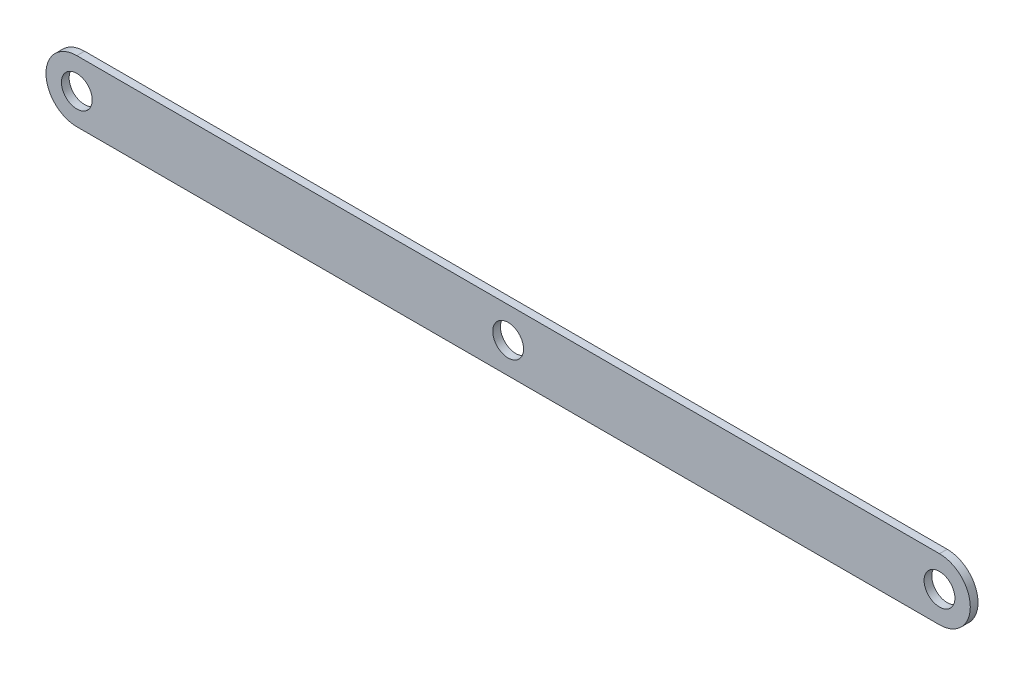
ISO-10303-21;
HEADER;
FILE_DESCRIPTION(('STEP AP214'),'2;1');
FILE_NAME('part.step','',(''),(''),'','','');
FILE_SCHEMA(('AUTOMOTIVE_DESIGN { 1 0 10303 214 1 1 1 1 }'));
ENDSEC;
DATA;
#1=APPLICATION_CONTEXT('core data for automotive mechanical design processes');
#2=APPLICATION_PROTOCOL_DEFINITION('international standard','automotive_design',2000,#1);
#3=PRODUCT_CONTEXT('',#1,'mechanical');
#4=PRODUCT('Part','Part','',(#3));
#5=PRODUCT_RELATED_PRODUCT_CATEGORY('part','',(#4));
#6=PRODUCT_DEFINITION_FORMATION('','',#4);
#7=PRODUCT_DEFINITION_CONTEXT('part definition',#1,'design');
#8=PRODUCT_DEFINITION('design','',#6,#7);
#9=PRODUCT_DEFINITION_SHAPE('','',#8);
#10=(LENGTH_UNIT() NAMED_UNIT(*) SI_UNIT(.MILLI.,.METRE.));
#11=(NAMED_UNIT(*) PLANE_ANGLE_UNIT() SI_UNIT($,.RADIAN.));
#12=(NAMED_UNIT(*) SI_UNIT($,.STERADIAN.) SOLID_ANGLE_UNIT());
#13=UNCERTAINTY_MEASURE_WITH_UNIT(LENGTH_MEASURE(1.E-05),#10,'distance_accuracy_value','');
#14=(GEOMETRIC_REPRESENTATION_CONTEXT(3) GLOBAL_UNCERTAINTY_ASSIGNED_CONTEXT((#13)) GLOBAL_UNIT_ASSIGNED_CONTEXT((#10,
#11,#12)) REPRESENTATION_CONTEXT('',''));
#15=CARTESIAN_POINT('',(0.,0.,0.));
#16=DIRECTION('',(0.,0.,1.));
#17=DIRECTION('',(1.,0.,0.));
#18=AXIS2_PLACEMENT_3D('',#15,#16,#17);
#19=CARTESIAN_POINT('',(177.8,0.,3.175));
#20=DIRECTION('',(0.,0.,1.));
#21=DIRECTION('',(1.,0.,0.));
#22=AXIS2_PLACEMENT_3D('',#19,#20,#21);
#23=PLANE('',#22);
#24=CARTESIAN_POINT('',(0.,0.,3.175));
#25=DIRECTION('',(0.,0.,1.));
#26=DIRECTION('',(1.,0.,0.));
#27=AXIS2_PLACEMENT_3D('',#24,#25,#26);
#28=CIRCLE('',#27,6.35);
#29=CARTESIAN_POINT('',(6.35,0.,3.175));
#30=VERTEX_POINT('',#29);
#31=EDGE_CURVE('E115',#30,#30,#28,.T.);
#32=ORIENTED_EDGE('',*,*,#31,.F.);
#33=EDGE_LOOP('',(#32));
#34=FACE_BOUND('',#33,.T.);
#35=CARTESIAN_POINT('',(177.8,0.,3.175));
#36=DIRECTION('',(0.,0.,1.));
#37=DIRECTION('',(1.,0.,0.));
#38=AXIS2_PLACEMENT_3D('',#35,#36,#37);
#39=CIRCLE('',#38,12.7);
#40=CARTESIAN_POINT('',(177.8,-12.6999999999999,3.175));
#41=VERTEX_POINT('',#40);
#42=CARTESIAN_POINT('',(177.8,12.7000000000001,3.175));
#43=VERTEX_POINT('',#42);
#44=EDGE_CURVE('E85',#41,#43,#39,.T.);
#45=ORIENTED_EDGE('',*,*,#44,.T.);
#46=DIRECTION('',(-1.,0.,0.));
#47=VECTOR('',#46,1.);
#48=CARTESIAN_POINT('',(177.8,12.7000000000001,3.175));
#49=LINE('',#48,#47);
#50=CARTESIAN_POINT('',(-177.8,12.7,3.175));
#51=VERTEX_POINT('',#50);
#52=EDGE_CURVE('E80',#43,#51,#49,.T.);
#53=ORIENTED_EDGE('',*,*,#52,.T.);
#54=CARTESIAN_POINT('',(-177.8,0.,3.175));
#55=DIRECTION('',(0.,0.,1.));
#56=DIRECTION('',(1.,0.,0.));
#57=AXIS2_PLACEMENT_3D('',#54,#55,#56);
#58=CIRCLE('',#57,12.7);
#59=CARTESIAN_POINT('',(-177.8,-12.7,3.175));
#60=VERTEX_POINT('',#59);
#61=EDGE_CURVE('E83',#51,#60,#58,.T.);
#62=ORIENTED_EDGE('',*,*,#61,.T.);
#63=DIRECTION('',(1.,0.,0.));
#64=VECTOR('',#63,1.);
#65=CARTESIAN_POINT('',(177.8,-12.6999999999999,3.175));
#66=LINE('',#65,#64);
#67=EDGE_CURVE('E50',#60,#41,#66,.T.);
#68=ORIENTED_EDGE('',*,*,#67,.T.);
#69=EDGE_LOOP('',(#45,#53,#62,#68));
#70=FACE_BOUND('',#69,.T.);
#71=CARTESIAN_POINT('',(-177.8,0.,3.175));
#72=DIRECTION('',(0.,0.,1.));
#73=DIRECTION('',(1.,0.,0.));
#74=AXIS2_PLACEMENT_3D('',#71,#72,#73);
#75=CIRCLE('',#74,6.35);
#76=CARTESIAN_POINT('',(-171.45,0.,3.175));
#77=VERTEX_POINT('',#76);
#78=EDGE_CURVE('E100',#77,#77,#75,.T.);
#79=ORIENTED_EDGE('',*,*,#78,.F.);
#80=EDGE_LOOP('',(#79));
#81=FACE_BOUND('',#80,.T.);
#82=CARTESIAN_POINT('',(177.8,0.,3.175));
#83=DIRECTION('',(0.,0.,1.));
#84=DIRECTION('',(1.,0.,0.));
#85=AXIS2_PLACEMENT_3D('',#82,#83,#84);
#86=CIRCLE('',#85,6.35);
#87=CARTESIAN_POINT('',(184.15,0.,3.175));
#88=VERTEX_POINT('',#87);
#89=EDGE_CURVE('E121',#88,#88,#86,.T.);
#90=ORIENTED_EDGE('',*,*,#89,.F.);
#91=EDGE_LOOP('',(#90));
#92=FACE_BOUND('',#91,.T.);
#93=ADVANCED_FACE('F33',(#34,#70,#81,#92),#23,.T.);
#94=CARTESIAN_POINT('',(177.8,0.,0.));
#95=DIRECTION('',(0.,0.,1.));
#96=DIRECTION('',(1.,0.,0.));
#97=AXIS2_PLACEMENT_3D('',#94,#95,#96);
#98=PLANE('',#97);
#99=CARTESIAN_POINT('',(177.8,0.,0.));
#100=DIRECTION('',(0.,0.,1.));
#101=DIRECTION('',(1.,0.,0.));
#102=AXIS2_PLACEMENT_3D('',#99,#100,#101);
#103=CIRCLE('',#102,12.7);
#104=CARTESIAN_POINT('',(177.8,-12.6999999999999,0.));
#105=VERTEX_POINT('',#104);
#106=CARTESIAN_POINT('',(177.8,12.7000000000001,0.));
#107=VERTEX_POINT('',#106);
#108=EDGE_CURVE('E97',#105,#107,#103,.T.);
#109=ORIENTED_EDGE('',*,*,#108,.F.);
#110=DIRECTION('',(1.,0.,0.));
#111=VECTOR('',#110,1.);
#112=CARTESIAN_POINT('',(177.8,-12.6999999999999,0.));
#113=LINE('',#112,#111);
#114=CARTESIAN_POINT('',(-177.8,-12.7,0.));
#115=VERTEX_POINT('',#114);
#116=EDGE_CURVE('E73',#115,#105,#113,.T.);
#117=ORIENTED_EDGE('',*,*,#116,.F.);
#118=CARTESIAN_POINT('',(-177.8,0.,0.));
#119=DIRECTION('',(0.,0.,1.));
#120=DIRECTION('',(1.,0.,0.));
#121=AXIS2_PLACEMENT_3D('',#118,#119,#120);
#122=CIRCLE('',#121,12.7);
#123=CARTESIAN_POINT('',(-177.8,12.7,0.));
#124=VERTEX_POINT('',#123);
#125=EDGE_CURVE('E67',#124,#115,#122,.T.);
#126=ORIENTED_EDGE('',*,*,#125,.F.);
#127=DIRECTION('',(-1.,0.,0.));
#128=VECTOR('',#127,1.);
#129=CARTESIAN_POINT('',(177.8,12.7000000000001,0.));
#130=LINE('',#129,#128);
#131=EDGE_CURVE('E89',#107,#124,#130,.T.);
#132=ORIENTED_EDGE('',*,*,#131,.F.);
#133=EDGE_LOOP('',(#109,#117,#126,#132));
#134=FACE_BOUND('',#133,.T.);
#135=CARTESIAN_POINT('',(-177.8,0.,0.));
#136=DIRECTION('',(0.,0.,1.));
#137=DIRECTION('',(1.,0.,0.));
#138=AXIS2_PLACEMENT_3D('',#135,#136,#137);
#139=CIRCLE('',#138,6.35);
#140=CARTESIAN_POINT('',(-171.45,0.,0.));
#141=VERTEX_POINT('',#140);
#142=EDGE_CURVE('E112',#141,#141,#139,.T.);
#143=ORIENTED_EDGE('',*,*,#142,.T.);
#144=EDGE_LOOP('',(#143));
#145=FACE_BOUND('',#144,.T.);
#146=CARTESIAN_POINT('',(0.,0.,0.));
#147=DIRECTION('',(0.,0.,1.));
#148=DIRECTION('',(1.,0.,0.));
#149=AXIS2_PLACEMENT_3D('',#146,#147,#148);
#150=CIRCLE('',#149,6.35);
#151=CARTESIAN_POINT('',(6.35,0.,0.));
#152=VERTEX_POINT('',#151);
#153=EDGE_CURVE('E118',#152,#152,#150,.T.);
#154=ORIENTED_EDGE('',*,*,#153,.T.);
#155=EDGE_LOOP('',(#154));
#156=FACE_BOUND('',#155,.T.);
#157=CARTESIAN_POINT('',(177.8,0.,0.));
#158=DIRECTION('',(0.,0.,1.));
#159=DIRECTION('',(1.,0.,0.));
#160=AXIS2_PLACEMENT_3D('',#157,#158,#159);
#161=CIRCLE('',#160,6.35);
#162=CARTESIAN_POINT('',(184.15,0.,0.));
#163=VERTEX_POINT('',#162);
#164=EDGE_CURVE('E124',#163,#163,#161,.T.);
#165=ORIENTED_EDGE('',*,*,#164,.T.);
#166=EDGE_LOOP('',(#165));
#167=FACE_BOUND('',#166,.T.);
#168=ADVANCED_FACE('F108',(#134,#145,#156,#167),#98,.F.);
#169=CARTESIAN_POINT('',(177.8,0.,3.175));
#170=DIRECTION('',(0.,0.,-1.));
#171=DIRECTION('',(-1.,0.,0.));
#172=AXIS2_PLACEMENT_3D('',#169,#170,#171);
#173=CYLINDRICAL_SURFACE('',#172,12.7);
#174=ORIENTED_EDGE('',*,*,#108,.T.);
#175=DIRECTION('',(0.,0.,-1.));
#176=VECTOR('',#175,1.);
#177=CARTESIAN_POINT('',(177.8,12.7000000000001,3.175));
#178=LINE('',#177,#176);
#179=EDGE_CURVE('E11',#43,#107,#178,.T.);
#180=ORIENTED_EDGE('',*,*,#179,.F.);
#181=ORIENTED_EDGE('',*,*,#44,.F.);
#182=DIRECTION('',(0.,0.,-1.));
#183=VECTOR('',#182,1.);
#184=CARTESIAN_POINT('',(177.8,-12.6999999999999,3.175));
#185=LINE('',#184,#183);
#186=EDGE_CURVE('E93',#41,#105,#185,.T.);
#187=ORIENTED_EDGE('',*,*,#186,.T.);
#188=EDGE_LOOP('',(#174,#180,#181,#187));
#189=FACE_BOUND('',#188,.T.);
#190=ADVANCED_FACE('F35',(#189),#173,.T.);
#191=CARTESIAN_POINT('',(177.8,12.7000000000001,3.175));
#192=DIRECTION('',(0.,-1.,0.));
#193=DIRECTION('',(1.,0.,0.));
#194=AXIS2_PLACEMENT_3D('',#191,#192,#193);
#195=PLANE('',#194);
#196=ORIENTED_EDGE('',*,*,#131,.T.);
#197=DIRECTION('',(0.,0.,-1.));
#198=VECTOR('',#197,1.);
#199=CARTESIAN_POINT('',(-177.8,12.7,3.175));
#200=LINE('',#199,#198);
#201=EDGE_CURVE('E42',#51,#124,#200,.T.);
#202=ORIENTED_EDGE('',*,*,#201,.F.);
#203=ORIENTED_EDGE('',*,*,#52,.F.);
#204=ORIENTED_EDGE('',*,*,#179,.T.);
#205=EDGE_LOOP('',(#196,#202,#203,#204));
#206=FACE_BOUND('',#205,.T.);
#207=ADVANCED_FACE('F88',(#206),#195,.F.);
#208=CARTESIAN_POINT('',(-177.8,0.,3.175));
#209=DIRECTION('',(0.,0.,-1.));
#210=DIRECTION('',(-1.,0.,0.));
#211=AXIS2_PLACEMENT_3D('',#208,#209,#210);
#212=CYLINDRICAL_SURFACE('',#211,12.7);
#213=ORIENTED_EDGE('',*,*,#125,.T.);
#214=DIRECTION('',(0.,0.,-1.));
#215=VECTOR('',#214,1.);
#216=CARTESIAN_POINT('',(-177.8,-12.7,3.175));
#217=LINE('',#216,#215);
#218=EDGE_CURVE('E90',#60,#115,#217,.T.);
#219=ORIENTED_EDGE('',*,*,#218,.F.);
#220=ORIENTED_EDGE('',*,*,#61,.F.);
#221=ORIENTED_EDGE('',*,*,#201,.T.);
#222=EDGE_LOOP('',(#213,#219,#220,#221));
#223=FACE_BOUND('',#222,.T.);
#224=ADVANCED_FACE('F91',(#223),#212,.T.);
#225=CARTESIAN_POINT('',(177.8,-12.6999999999999,3.175));
#226=DIRECTION('',(0.,1.,0.));
#227=DIRECTION('',(-1.,0.,0.));
#228=AXIS2_PLACEMENT_3D('',#225,#226,#227);
#229=PLANE('',#228);
#230=ORIENTED_EDGE('',*,*,#116,.T.);
#231=ORIENTED_EDGE('',*,*,#186,.F.);
#232=ORIENTED_EDGE('',*,*,#67,.F.);
#233=ORIENTED_EDGE('',*,*,#218,.T.);
#234=EDGE_LOOP('',(#230,#231,#232,#233));
#235=FACE_BOUND('',#234,.T.);
#236=ADVANCED_FACE('F105',(#235),#229,.F.);
#237=CARTESIAN_POINT('',(-177.8,0.,3.175));
#238=DIRECTION('',(0.,0.,-1.));
#239=DIRECTION('',(-1.,0.,0.));
#240=AXIS2_PLACEMENT_3D('',#237,#238,#239);
#241=CYLINDRICAL_SURFACE('',#240,6.35);
#242=ORIENTED_EDGE('',*,*,#78,.T.);
#243=EDGE_LOOP('',(#242));
#244=FACE_BOUND('',#243,.T.);
#245=ORIENTED_EDGE('',*,*,#142,.F.);
#246=EDGE_LOOP('',(#245));
#247=FACE_BOUND('',#246,.T.);
#248=ADVANCED_FACE('F142',(#244,#247),#241,.F.);
#249=CARTESIAN_POINT('',(0.,0.,3.175));
#250=DIRECTION('',(0.,0.,-1.));
#251=DIRECTION('',(-1.,0.,0.));
#252=AXIS2_PLACEMENT_3D('',#249,#250,#251);
#253=CYLINDRICAL_SURFACE('',#252,6.35);
#254=ORIENTED_EDGE('',*,*,#31,.T.);
#255=EDGE_LOOP('',(#254));
#256=FACE_BOUND('',#255,.T.);
#257=ORIENTED_EDGE('',*,*,#153,.F.);
#258=EDGE_LOOP('',(#257));
#259=FACE_BOUND('',#258,.T.);
#260=ADVANCED_FACE('F188',(#256,#259),#253,.F.);
#261=CARTESIAN_POINT('',(177.8,0.,3.175));
#262=DIRECTION('',(0.,0.,-1.));
#263=DIRECTION('',(-1.,0.,0.));
#264=AXIS2_PLACEMENT_3D('',#261,#262,#263);
#265=CYLINDRICAL_SURFACE('',#264,6.35);
#266=ORIENTED_EDGE('',*,*,#89,.T.);
#267=EDGE_LOOP('',(#266));
#268=FACE_BOUND('',#267,.T.);
#269=ORIENTED_EDGE('',*,*,#164,.F.);
#270=EDGE_LOOP('',(#269));
#271=FACE_BOUND('',#270,.T.);
#272=ADVANCED_FACE('F130',(#268,#271),#265,.F.);
#273=CLOSED_SHELL('',(#93,#168,#190,#207,#224,#236,#248,#260,#272));
#274=MANIFOLD_SOLID_BREP('B2',#273);
#275=ADVANCED_BREP_SHAPE_REPRESENTATION('',(#18,#274),#14);
#276=SHAPE_DEFINITION_REPRESENTATION(#9,#275);
ENDSEC;
END-ISO-10303-21;
